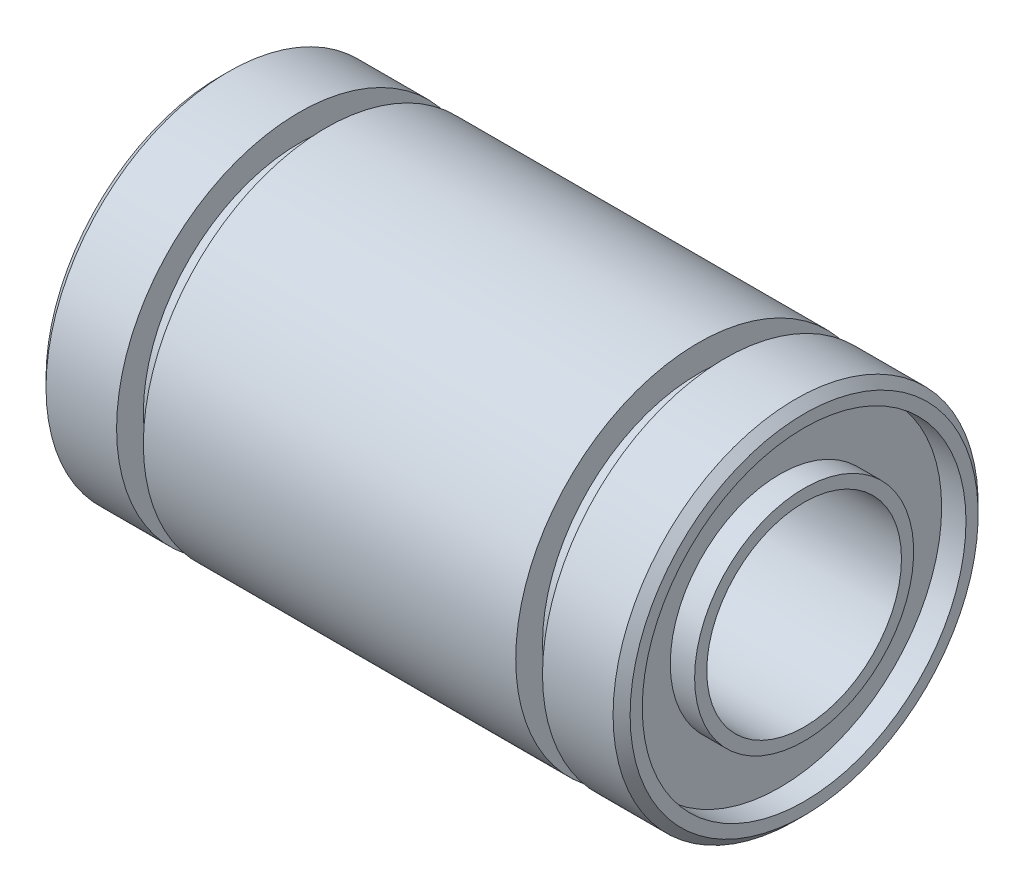
ISO-10303-21;
HEADER;
FILE_DESCRIPTION(('STEP AP214'),'2;1');
FILE_NAME('part.step','',(''),(''),'','','');
FILE_SCHEMA(('AUTOMOTIVE_DESIGN { 1 0 10303 214 1 1 1 1 }'));
ENDSEC;
DATA;
#1=APPLICATION_CONTEXT('core data for automotive mechanical design processes');
#2=APPLICATION_PROTOCOL_DEFINITION('international standard','automotive_design',2000,#1);
#3=PRODUCT_CONTEXT('',#1,'mechanical');
#4=PRODUCT('Part','Part','',(#3));
#5=PRODUCT_RELATED_PRODUCT_CATEGORY('part','',(#4));
#6=PRODUCT_DEFINITION_FORMATION('','',#4);
#7=PRODUCT_DEFINITION_CONTEXT('part definition',#1,'design');
#8=PRODUCT_DEFINITION('design','',#6,#7);
#9=PRODUCT_DEFINITION_SHAPE('','',#8);
#10=(LENGTH_UNIT() NAMED_UNIT(*) SI_UNIT(.MILLI.,.METRE.));
#11=(NAMED_UNIT(*) PLANE_ANGLE_UNIT() SI_UNIT($,.RADIAN.));
#12=(NAMED_UNIT(*) SI_UNIT($,.STERADIAN.) SOLID_ANGLE_UNIT());
#13=UNCERTAINTY_MEASURE_WITH_UNIT(LENGTH_MEASURE(1.E-05),#10,'distance_accuracy_value','');
#14=(GEOMETRIC_REPRESENTATION_CONTEXT(3) GLOBAL_UNCERTAINTY_ASSIGNED_CONTEXT((#13)) GLOBAL_UNIT_ASSIGNED_CONTEXT((#10,
#11,#12)) REPRESENTATION_CONTEXT('',''));
#15=CARTESIAN_POINT('',(0.,0.,0.));
#16=DIRECTION('',(0.,0.,1.));
#17=DIRECTION('',(1.,0.,0.));
#18=AXIS2_PLACEMENT_3D('',#15,#16,#17);
#19=CARTESIAN_POINT('',(11.65,0.,0.));
#20=DIRECTION('',(-1.,0.,0.));
#21=DIRECTION('',(0.,0.,1.));
#22=AXIS2_PLACEMENT_3D('',#19,#20,#21);
#23=CONICAL_SURFACE('',#22,7.5,0.78539816339745);
#24=CARTESIAN_POINT('',(12.,0.,0.));
#25=DIRECTION('',(-1.,0.,0.));
#26=DIRECTION('',(0.,0.,1.));
#27=AXIS2_PLACEMENT_3D('',#24,#25,#26);
#28=CIRCLE('',#27,7.15);
#29=CARTESIAN_POINT('',(12.,0.,7.15));
#30=VERTEX_POINT('',#29);
#31=EDGE_CURVE('E130',#30,#30,#28,.T.);
#32=ORIENTED_EDGE('',*,*,#31,.T.);
#33=EDGE_LOOP('',(#32));
#34=FACE_BOUND('',#33,.T.);
#35=CARTESIAN_POINT('',(11.65,0.,0.));
#36=DIRECTION('',(-1.,0.,0.));
#37=DIRECTION('',(0.,0.,1.));
#38=AXIS2_PLACEMENT_3D('',#35,#36,#37);
#39=CIRCLE('',#38,7.5);
#40=CARTESIAN_POINT('',(11.65,0.,7.5));
#41=VERTEX_POINT('',#40);
#42=EDGE_CURVE('E10',#41,#41,#39,.T.);
#43=ORIENTED_EDGE('',*,*,#42,.F.);
#44=EDGE_LOOP('',(#43));
#45=FACE_BOUND('',#44,.T.);
#46=ADVANCED_FACE('F38',(#34,#45),#23,.T.);
#47=CARTESIAN_POINT('',(-45.6895053247726,0.,0.));
#48=DIRECTION('',(-1.,0.,0.));
#49=DIRECTION('',(0.,0.,1.));
#50=AXIS2_PLACEMENT_3D('',#47,#48,#49);
#51=CYLINDRICAL_SURFACE('',#50,7.5);
#52=CARTESIAN_POINT('',(8.75000000000001,0.,0.));
#53=DIRECTION('',(-1.,0.,0.));
#54=DIRECTION('',(0.,0.,1.));
#55=AXIS2_PLACEMENT_3D('',#52,#53,#54);
#56=CIRCLE('',#55,7.5);
#57=CARTESIAN_POINT('',(8.75000000000001,0.,7.5));
#58=VERTEX_POINT('',#57);
#59=EDGE_CURVE('E45',#58,#58,#56,.T.);
#60=ORIENTED_EDGE('',*,*,#59,.F.);
#61=EDGE_LOOP('',(#60));
#62=FACE_BOUND('',#61,.T.);
#63=ORIENTED_EDGE('',*,*,#42,.T.);
#64=EDGE_LOOP('',(#63));
#65=FACE_BOUND('',#64,.T.);
#66=ADVANCED_FACE('F148',(#62,#65),#51,.T.);
#67=CARTESIAN_POINT('',(8.75000000000001,0.,0.));
#68=DIRECTION('',(1.,0.,0.));
#69=DIRECTION('',(0.,0.,-1.));
#70=AXIS2_PLACEMENT_3D('',#67,#68,#69);
#71=PLANE('',#70);
#72=CARTESIAN_POINT('',(8.75000000000001,0.,0.));
#73=DIRECTION('',(-1.,0.,0.));
#74=DIRECTION('',(0.,0.,1.));
#75=AXIS2_PLACEMENT_3D('',#72,#73,#74);
#76=CIRCLE('',#75,6.4);
#77=CARTESIAN_POINT('',(8.75000000000001,0.,6.4));
#78=VERTEX_POINT('',#77);
#79=EDGE_CURVE('E52',#78,#78,#76,.T.);
#80=ORIENTED_EDGE('',*,*,#79,.F.);
#81=EDGE_LOOP('',(#80));
#82=FACE_BOUND('',#81,.T.);
#83=ORIENTED_EDGE('',*,*,#59,.T.);
#84=EDGE_LOOP('',(#83));
#85=FACE_BOUND('',#84,.T.);
#86=ADVANCED_FACE('F152',(#82,#85),#71,.F.);
#87=CARTESIAN_POINT('',(-45.6895053247726,0.,0.));
#88=DIRECTION('',(-1.,0.,0.));
#89=DIRECTION('',(0.,0.,1.));
#90=AXIS2_PLACEMENT_3D('',#87,#88,#89);
#91=CYLINDRICAL_SURFACE('',#90,6.4);
#92=CARTESIAN_POINT('',(7.65,0.,0.));
#93=DIRECTION('',(-1.,0.,0.));
#94=DIRECTION('',(0.,0.,1.));
#95=AXIS2_PLACEMENT_3D('',#92,#93,#94);
#96=CIRCLE('',#95,6.4);
#97=CARTESIAN_POINT('',(7.65,0.,6.4));
#98=VERTEX_POINT('',#97);
#99=EDGE_CURVE('E59',#98,#98,#96,.T.);
#100=ORIENTED_EDGE('',*,*,#99,.F.);
#101=EDGE_LOOP('',(#100));
#102=FACE_BOUND('',#101,.T.);
#103=ORIENTED_EDGE('',*,*,#79,.T.);
#104=EDGE_LOOP('',(#103));
#105=FACE_BOUND('',#104,.T.);
#106=ADVANCED_FACE('F157',(#102,#105),#91,.T.);
#107=CARTESIAN_POINT('',(7.65,0.,0.));
#108=DIRECTION('',(-1.,0.,0.));
#109=DIRECTION('',(0.,0.,1.));
#110=AXIS2_PLACEMENT_3D('',#107,#108,#109);
#111=PLANE('',#110);
#112=CARTESIAN_POINT('',(7.65,0.,0.));
#113=DIRECTION('',(-1.,0.,0.));
#114=DIRECTION('',(0.,0.,1.));
#115=AXIS2_PLACEMENT_3D('',#112,#113,#114);
#116=CIRCLE('',#115,7.5);
#117=CARTESIAN_POINT('',(7.65,0.,7.5));
#118=VERTEX_POINT('',#117);
#119=EDGE_CURVE('E64',#118,#118,#116,.T.);
#120=ORIENTED_EDGE('',*,*,#119,.F.);
#121=EDGE_LOOP('',(#120));
#122=FACE_BOUND('',#121,.T.);
#123=ORIENTED_EDGE('',*,*,#99,.T.);
#124=EDGE_LOOP('',(#123));
#125=FACE_BOUND('',#124,.T.);
#126=ADVANCED_FACE('F163',(#122,#125),#111,.F.);
#127=CARTESIAN_POINT('',(-45.6895053247726,0.,0.));
#128=DIRECTION('',(-1.,0.,0.));
#129=DIRECTION('',(0.,0.,1.));
#130=AXIS2_PLACEMENT_3D('',#127,#128,#129);
#131=CYLINDRICAL_SURFACE('',#130,7.5);
#132=ORIENTED_EDGE('',*,*,#119,.T.);
#133=EDGE_LOOP('',(#132));
#134=FACE_BOUND('',#133,.T.);
#135=CARTESIAN_POINT('',(-7.65,0.,0.));
#136=DIRECTION('',(-1.,0.,0.));
#137=DIRECTION('',(0.,0.,1.));
#138=AXIS2_PLACEMENT_3D('',#135,#136,#137);
#139=CIRCLE('',#138,7.5);
#140=CARTESIAN_POINT('',(-7.65,0.,7.5));
#141=VERTEX_POINT('',#140);
#142=EDGE_CURVE('E67',#141,#141,#139,.T.);
#143=ORIENTED_EDGE('',*,*,#142,.F.);
#144=EDGE_LOOP('',(#143));
#145=FACE_BOUND('',#144,.T.);
#146=ADVANCED_FACE('F167',(#134,#145),#131,.T.);
#147=CARTESIAN_POINT('',(-7.65,0.,0.));
#148=DIRECTION('',(-1.,0.,0.));
#149=DIRECTION('',(0.,0.,1.));
#150=AXIS2_PLACEMENT_3D('',#147,#148,#149);
#151=PLANE('',#150);
#152=ORIENTED_EDGE('',*,*,#142,.T.);
#153=EDGE_LOOP('',(#152));
#154=FACE_BOUND('',#153,.T.);
#155=CARTESIAN_POINT('',(-7.65,0.,0.));
#156=DIRECTION('',(-1.,0.,0.));
#157=DIRECTION('',(0.,0.,1.));
#158=AXIS2_PLACEMENT_3D('',#155,#156,#157);
#159=CIRCLE('',#158,6.4);
#160=CARTESIAN_POINT('',(-7.65,0.,6.4));
#161=VERTEX_POINT('',#160);
#162=EDGE_CURVE('E71',#161,#161,#159,.T.);
#163=ORIENTED_EDGE('',*,*,#162,.F.);
#164=EDGE_LOOP('',(#163));
#165=FACE_BOUND('',#164,.T.);
#166=ADVANCED_FACE('F171',(#154,#165),#151,.T.);
#167=CARTESIAN_POINT('',(-45.6895053247726,0.,0.));
#168=DIRECTION('',(-1.,0.,0.));
#169=DIRECTION('',(0.,0.,1.));
#170=AXIS2_PLACEMENT_3D('',#167,#168,#169);
#171=CYLINDRICAL_SURFACE('',#170,6.4);
#172=ORIENTED_EDGE('',*,*,#162,.T.);
#173=EDGE_LOOP('',(#172));
#174=FACE_BOUND('',#173,.T.);
#175=CARTESIAN_POINT('',(-8.74999999999999,0.,0.));
#176=DIRECTION('',(-1.,0.,0.));
#177=DIRECTION('',(0.,0.,1.));
#178=AXIS2_PLACEMENT_3D('',#175,#176,#177);
#179=CIRCLE('',#178,6.4);
#180=CARTESIAN_POINT('',(-8.74999999999999,0.,6.4));
#181=VERTEX_POINT('',#180);
#182=EDGE_CURVE('E75',#181,#181,#179,.T.);
#183=ORIENTED_EDGE('',*,*,#182,.F.);
#184=EDGE_LOOP('',(#183));
#185=FACE_BOUND('',#184,.T.);
#186=ADVANCED_FACE('F175',(#174,#185),#171,.T.);
#187=CARTESIAN_POINT('',(-8.75,0.,0.));
#188=DIRECTION('',(1.,0.,0.));
#189=DIRECTION('',(0.,0.,-1.));
#190=AXIS2_PLACEMENT_3D('',#187,#188,#189);
#191=PLANE('',#190);
#192=ORIENTED_EDGE('',*,*,#182,.T.);
#193=EDGE_LOOP('',(#192));
#194=FACE_BOUND('',#193,.T.);
#195=CARTESIAN_POINT('',(-8.74999999999999,0.,0.));
#196=DIRECTION('',(-1.,0.,0.));
#197=DIRECTION('',(0.,0.,1.));
#198=AXIS2_PLACEMENT_3D('',#195,#196,#197);
#199=CIRCLE('',#198,7.5);
#200=CARTESIAN_POINT('',(-8.74999999999999,0.,7.5));
#201=VERTEX_POINT('',#200);
#202=EDGE_CURVE('E79',#201,#201,#199,.T.);
#203=ORIENTED_EDGE('',*,*,#202,.F.);
#204=EDGE_LOOP('',(#203));
#205=FACE_BOUND('',#204,.T.);
#206=ADVANCED_FACE('F179',(#194,#205),#191,.T.);
#207=CARTESIAN_POINT('',(-45.6895053247726,0.,0.));
#208=DIRECTION('',(-1.,0.,0.));
#209=DIRECTION('',(0.,0.,1.));
#210=AXIS2_PLACEMENT_3D('',#207,#208,#209);
#211=CYLINDRICAL_SURFACE('',#210,7.5);
#212=ORIENTED_EDGE('',*,*,#202,.T.);
#213=EDGE_LOOP('',(#212));
#214=FACE_BOUND('',#213,.T.);
#215=CARTESIAN_POINT('',(-11.65,0.,0.));
#216=DIRECTION('',(-1.,0.,0.));
#217=DIRECTION('',(0.,0.,1.));
#218=AXIS2_PLACEMENT_3D('',#215,#216,#217);
#219=CIRCLE('',#218,7.5);
#220=CARTESIAN_POINT('',(-11.65,0.,7.5));
#221=VERTEX_POINT('',#220);
#222=EDGE_CURVE('E83',#221,#221,#219,.T.);
#223=ORIENTED_EDGE('',*,*,#222,.F.);
#224=EDGE_LOOP('',(#223));
#225=FACE_BOUND('',#224,.T.);
#226=ADVANCED_FACE('F183',(#214,#225),#211,.T.);
#227=CARTESIAN_POINT('',(-11.65,0.,0.));
#228=DIRECTION('',(1.,0.,0.));
#229=DIRECTION('',(0.,0.,-1.));
#230=AXIS2_PLACEMENT_3D('',#227,#228,#229);
#231=CONICAL_SURFACE('',#230,7.5,0.78539816339745);
#232=CARTESIAN_POINT('',(-12.,0.,0.));
#233=DIRECTION('',(-1.,0.,0.));
#234=DIRECTION('',(0.,0.,1.));
#235=AXIS2_PLACEMENT_3D('',#232,#233,#234);
#236=CIRCLE('',#235,7.15);
#237=CARTESIAN_POINT('',(-12.,0.,7.15));
#238=VERTEX_POINT('',#237);
#239=EDGE_CURVE('E87',#238,#238,#236,.T.);
#240=ORIENTED_EDGE('',*,*,#239,.F.);
#241=EDGE_LOOP('',(#240));
#242=FACE_BOUND('',#241,.T.);
#243=ORIENTED_EDGE('',*,*,#222,.T.);
#244=EDGE_LOOP('',(#243));
#245=FACE_BOUND('',#244,.T.);
#246=ADVANCED_FACE('F187',(#242,#245),#231,.T.);
#247=CARTESIAN_POINT('',(-12.,0.,0.));
#248=DIRECTION('',(1.,0.,0.));
#249=DIRECTION('',(0.,0.,-1.));
#250=AXIS2_PLACEMENT_3D('',#247,#248,#249);
#251=PLANE('',#250);
#252=CARTESIAN_POINT('',(-12.,0.,0.));
#253=DIRECTION('',(-1.,0.,0.));
#254=DIRECTION('',(0.,0.,1.));
#255=AXIS2_PLACEMENT_3D('',#252,#253,#254);
#256=CIRCLE('',#255,6.65);
#257=CARTESIAN_POINT('',(-12.,0.,6.65));
#258=VERTEX_POINT('',#257);
#259=EDGE_CURVE('E91',#258,#258,#256,.T.);
#260=ORIENTED_EDGE('',*,*,#259,.F.);
#261=EDGE_LOOP('',(#260));
#262=FACE_BOUND('',#261,.T.);
#263=ORIENTED_EDGE('',*,*,#239,.T.);
#264=EDGE_LOOP('',(#263));
#265=FACE_BOUND('',#264,.T.);
#266=ADVANCED_FACE('F191',(#262,#265),#251,.F.);
#267=CARTESIAN_POINT('',(-45.6895053247726,0.,0.));
#268=DIRECTION('',(-1.,0.,0.));
#269=DIRECTION('',(0.,0.,1.));
#270=AXIS2_PLACEMENT_3D('',#267,#268,#269);
#271=CYLINDRICAL_SURFACE('',#270,6.65);
#272=CARTESIAN_POINT('',(-11.,0.,0.));
#273=DIRECTION('',(-1.,0.,0.));
#274=DIRECTION('',(0.,0.,1.));
#275=AXIS2_PLACEMENT_3D('',#272,#273,#274);
#276=CIRCLE('',#275,6.65);
#277=CARTESIAN_POINT('',(-11.,0.,6.65));
#278=VERTEX_POINT('',#277);
#279=EDGE_CURVE('E95',#278,#278,#276,.T.);
#280=ORIENTED_EDGE('',*,*,#279,.F.);
#281=EDGE_LOOP('',(#280));
#282=FACE_BOUND('',#281,.T.);
#283=ORIENTED_EDGE('',*,*,#259,.T.);
#284=EDGE_LOOP('',(#283));
#285=FACE_BOUND('',#284,.T.);
#286=ADVANCED_FACE('F195',(#282,#285),#271,.F.);
#287=CARTESIAN_POINT('',(-11.,0.,0.));
#288=DIRECTION('',(1.,0.,0.));
#289=DIRECTION('',(0.,0.,-1.));
#290=AXIS2_PLACEMENT_3D('',#287,#288,#289);
#291=PLANE('',#290);
#292=CARTESIAN_POINT('',(-11.,0.,0.));
#293=DIRECTION('',(-1.,0.,0.));
#294=DIRECTION('',(0.,0.,1.));
#295=AXIS2_PLACEMENT_3D('',#292,#293,#294);
#296=CIRCLE('',#295,4.5);
#297=CARTESIAN_POINT('',(-11.,0.,4.5));
#298=VERTEX_POINT('',#297);
#299=EDGE_CURVE('E99',#298,#298,#296,.T.);
#300=ORIENTED_EDGE('',*,*,#299,.F.);
#301=EDGE_LOOP('',(#300));
#302=FACE_BOUND('',#301,.T.);
#303=ORIENTED_EDGE('',*,*,#279,.T.);
#304=EDGE_LOOP('',(#303));
#305=FACE_BOUND('',#304,.T.);
#306=ADVANCED_FACE('F199',(#302,#305),#291,.F.);
#307=CARTESIAN_POINT('',(-45.6895053247726,0.,0.));
#308=DIRECTION('',(-1.,0.,0.));
#309=DIRECTION('',(0.,0.,1.));
#310=AXIS2_PLACEMENT_3D('',#307,#308,#309);
#311=CYLINDRICAL_SURFACE('',#310,4.5);
#312=CARTESIAN_POINT('',(-12.,0.,0.));
#313=DIRECTION('',(-1.,0.,0.));
#314=DIRECTION('',(0.,0.,1.));
#315=AXIS2_PLACEMENT_3D('',#312,#313,#314);
#316=CIRCLE('',#315,4.5);
#317=CARTESIAN_POINT('',(-12.,0.,4.5));
#318=VERTEX_POINT('',#317);
#319=EDGE_CURVE('E103',#318,#318,#316,.T.);
#320=ORIENTED_EDGE('',*,*,#319,.F.);
#321=EDGE_LOOP('',(#320));
#322=FACE_BOUND('',#321,.T.);
#323=ORIENTED_EDGE('',*,*,#299,.T.);
#324=EDGE_LOOP('',(#323));
#325=FACE_BOUND('',#324,.T.);
#326=ADVANCED_FACE('F203',(#322,#325),#311,.T.);
#327=CARTESIAN_POINT('',(-12.,0.,0.));
#328=DIRECTION('',(1.,0.,0.));
#329=DIRECTION('',(0.,0.,-1.));
#330=AXIS2_PLACEMENT_3D('',#327,#328,#329);
#331=PLANE('',#330);
#332=CARTESIAN_POINT('',(-12.,0.,0.));
#333=DIRECTION('',(-1.,0.,0.));
#334=DIRECTION('',(0.,0.,1.));
#335=AXIS2_PLACEMENT_3D('',#332,#333,#334);
#336=CIRCLE('',#335,4.);
#337=CARTESIAN_POINT('',(-12.,0.,4.));
#338=VERTEX_POINT('',#337);
#339=EDGE_CURVE('E107',#338,#338,#336,.T.);
#340=ORIENTED_EDGE('',*,*,#339,.F.);
#341=EDGE_LOOP('',(#340));
#342=FACE_BOUND('',#341,.T.);
#343=ORIENTED_EDGE('',*,*,#319,.T.);
#344=EDGE_LOOP('',(#343));
#345=FACE_BOUND('',#344,.T.);
#346=ADVANCED_FACE('F207',(#342,#345),#331,.F.);
#347=CARTESIAN_POINT('',(-45.6895053247726,0.,0.));
#348=DIRECTION('',(-1.,0.,0.));
#349=DIRECTION('',(0.,0.,1.));
#350=AXIS2_PLACEMENT_3D('',#347,#348,#349);
#351=CYLINDRICAL_SURFACE('',#350,4.);
#352=CARTESIAN_POINT('',(12.,0.,0.));
#353=DIRECTION('',(-1.,0.,0.));
#354=DIRECTION('',(0.,0.,1.));
#355=AXIS2_PLACEMENT_3D('',#352,#353,#354);
#356=CIRCLE('',#355,4.);
#357=CARTESIAN_POINT('',(12.,0.,4.));
#358=VERTEX_POINT('',#357);
#359=EDGE_CURVE('E111',#358,#358,#356,.T.);
#360=ORIENTED_EDGE('',*,*,#359,.F.);
#361=EDGE_LOOP('',(#360));
#362=FACE_BOUND('',#361,.T.);
#363=ORIENTED_EDGE('',*,*,#339,.T.);
#364=EDGE_LOOP('',(#363));
#365=FACE_BOUND('',#364,.T.);
#366=ADVANCED_FACE('F211',(#362,#365),#351,.F.);
#367=CARTESIAN_POINT('',(12.,0.,0.));
#368=DIRECTION('',(1.,0.,0.));
#369=DIRECTION('',(0.,0.,-1.));
#370=AXIS2_PLACEMENT_3D('',#367,#368,#369);
#371=PLANE('',#370);
#372=ORIENTED_EDGE('',*,*,#359,.T.);
#373=EDGE_LOOP('',(#372));
#374=FACE_BOUND('',#373,.T.);
#375=CARTESIAN_POINT('',(12.,0.,0.));
#376=DIRECTION('',(-1.,0.,0.));
#377=DIRECTION('',(0.,0.,1.));
#378=AXIS2_PLACEMENT_3D('',#375,#376,#377);
#379=CIRCLE('',#378,4.5);
#380=CARTESIAN_POINT('',(12.,0.,4.5));
#381=VERTEX_POINT('',#380);
#382=EDGE_CURVE('E115',#381,#381,#379,.T.);
#383=ORIENTED_EDGE('',*,*,#382,.F.);
#384=EDGE_LOOP('',(#383));
#385=FACE_BOUND('',#384,.T.);
#386=ADVANCED_FACE('F215',(#374,#385),#371,.T.);
#387=CARTESIAN_POINT('',(-45.6895053247726,0.,0.));
#388=DIRECTION('',(-1.,0.,0.));
#389=DIRECTION('',(0.,0.,1.));
#390=AXIS2_PLACEMENT_3D('',#387,#388,#389);
#391=CYLINDRICAL_SURFACE('',#390,4.5);
#392=ORIENTED_EDGE('',*,*,#382,.T.);
#393=EDGE_LOOP('',(#392));
#394=FACE_BOUND('',#393,.T.);
#395=CARTESIAN_POINT('',(11.,0.,0.));
#396=DIRECTION('',(-1.,0.,0.));
#397=DIRECTION('',(0.,0.,1.));
#398=AXIS2_PLACEMENT_3D('',#395,#396,#397);
#399=CIRCLE('',#398,4.5);
#400=CARTESIAN_POINT('',(11.,0.,4.5));
#401=VERTEX_POINT('',#400);
#402=EDGE_CURVE('E119',#401,#401,#399,.T.);
#403=ORIENTED_EDGE('',*,*,#402,.F.);
#404=EDGE_LOOP('',(#403));
#405=FACE_BOUND('',#404,.T.);
#406=ADVANCED_FACE('F219',(#394,#405),#391,.T.);
#407=CARTESIAN_POINT('',(11.,0.,0.));
#408=DIRECTION('',(1.,0.,0.));
#409=DIRECTION('',(0.,0.,-1.));
#410=AXIS2_PLACEMENT_3D('',#407,#408,#409);
#411=PLANE('',#410);
#412=ORIENTED_EDGE('',*,*,#402,.T.);
#413=EDGE_LOOP('',(#412));
#414=FACE_BOUND('',#413,.T.);
#415=CARTESIAN_POINT('',(11.,0.,0.));
#416=DIRECTION('',(-1.,0.,0.));
#417=DIRECTION('',(0.,0.,1.));
#418=AXIS2_PLACEMENT_3D('',#415,#416,#417);
#419=CIRCLE('',#418,6.65);
#420=CARTESIAN_POINT('',(11.,0.,6.65));
#421=VERTEX_POINT('',#420);
#422=EDGE_CURVE('E123',#421,#421,#419,.T.);
#423=ORIENTED_EDGE('',*,*,#422,.F.);
#424=EDGE_LOOP('',(#423));
#425=FACE_BOUND('',#424,.T.);
#426=ADVANCED_FACE('F144',(#414,#425),#411,.T.);
#427=CARTESIAN_POINT('',(-45.6895053247726,0.,0.));
#428=DIRECTION('',(-1.,0.,0.));
#429=DIRECTION('',(0.,0.,1.));
#430=AXIS2_PLACEMENT_3D('',#427,#428,#429);
#431=CYLINDRICAL_SURFACE('',#430,6.65);
#432=ORIENTED_EDGE('',*,*,#422,.T.);
#433=EDGE_LOOP('',(#432));
#434=FACE_BOUND('',#433,.T.);
#435=CARTESIAN_POINT('',(12.,0.,0.));
#436=DIRECTION('',(-1.,0.,0.));
#437=DIRECTION('',(0.,0.,1.));
#438=AXIS2_PLACEMENT_3D('',#435,#436,#437);
#439=CIRCLE('',#438,6.65);
#440=CARTESIAN_POINT('',(12.,0.,6.65));
#441=VERTEX_POINT('',#440);
#442=EDGE_CURVE('E126',#441,#441,#439,.T.);
#443=ORIENTED_EDGE('',*,*,#442,.F.);
#444=EDGE_LOOP('',(#443));
#445=FACE_BOUND('',#444,.T.);
#446=ADVANCED_FACE('F138',(#434,#445),#431,.F.);
#447=CARTESIAN_POINT('',(12.,0.,0.));
#448=DIRECTION('',(1.,0.,0.));
#449=DIRECTION('',(0.,0.,-1.));
#450=AXIS2_PLACEMENT_3D('',#447,#448,#449);
#451=PLANE('',#450);
#452=ORIENTED_EDGE('',*,*,#442,.T.);
#453=EDGE_LOOP('',(#452));
#454=FACE_BOUND('',#453,.T.);
#455=ORIENTED_EDGE('',*,*,#31,.F.);
#456=EDGE_LOOP('',(#455));
#457=FACE_BOUND('',#456,.T.);
#458=ADVANCED_FACE('F136',(#454,#457),#451,.T.);
#459=CLOSED_SHELL('',(#46,#66,#86,#106,#126,#146,#166,#186,#206,#226,#246,#266,#286,#306,#326,
#346,#366,#386,#406,#426,#446,#458));
#460=MANIFOLD_SOLID_BREP('B2',#459);
#461=ADVANCED_BREP_SHAPE_REPRESENTATION('',(#18,#460),#14);
#462=SHAPE_DEFINITION_REPRESENTATION(#9,#461);
ENDSEC;
END-ISO-10303-21;
